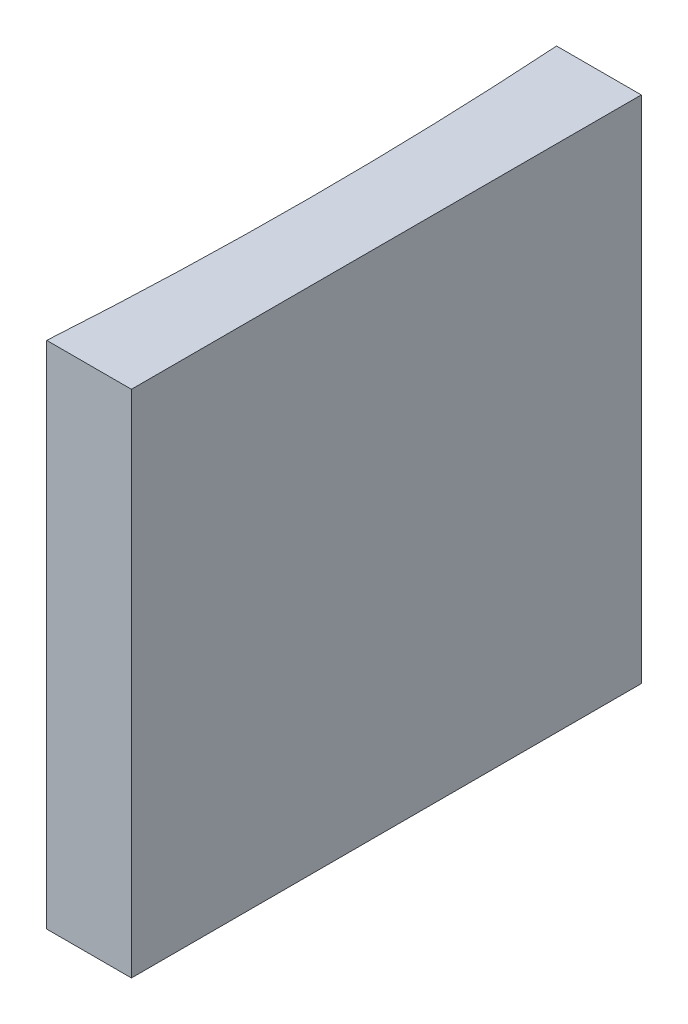
ISO-10303-21;
HEADER;
FILE_DESCRIPTION(('STEP AP214'),'2;1');
FILE_NAME('part.step','',(''),(''),'','','');
FILE_SCHEMA(('AUTOMOTIVE_DESIGN { 1 0 10303 214 1 1 1 1 }'));
ENDSEC;
DATA;
#1=APPLICATION_CONTEXT('core data for automotive mechanical design processes');
#2=APPLICATION_PROTOCOL_DEFINITION('international standard','automotive_design',2000,#1);
#3=PRODUCT_CONTEXT('',#1,'mechanical');
#4=PRODUCT('Part','Part','',(#3));
#5=PRODUCT_RELATED_PRODUCT_CATEGORY('part','',(#4));
#6=PRODUCT_DEFINITION_FORMATION('','',#4);
#7=PRODUCT_DEFINITION_CONTEXT('part definition',#1,'design');
#8=PRODUCT_DEFINITION('design','',#6,#7);
#9=PRODUCT_DEFINITION_SHAPE('','',#8);
#10=(LENGTH_UNIT() NAMED_UNIT(*) SI_UNIT(.MILLI.,.METRE.));
#11=(NAMED_UNIT(*) PLANE_ANGLE_UNIT() SI_UNIT($,.RADIAN.));
#12=(NAMED_UNIT(*) SI_UNIT($,.STERADIAN.) SOLID_ANGLE_UNIT());
#13=UNCERTAINTY_MEASURE_WITH_UNIT(LENGTH_MEASURE(1.E-05),#10,'distance_accuracy_value','');
#14=(GEOMETRIC_REPRESENTATION_CONTEXT(3) GLOBAL_UNCERTAINTY_ASSIGNED_CONTEXT((#13)) GLOBAL_UNIT_ASSIGNED_CONTEXT((#10,
#11,#12)) REPRESENTATION_CONTEXT('',''));
#15=CARTESIAN_POINT('',(0.,0.,0.));
#16=DIRECTION('',(0.,0.,1.));
#17=DIRECTION('',(1.,0.,0.));
#18=AXIS2_PLACEMENT_3D('',#15,#16,#17);
#19=CARTESIAN_POINT('',(0.,20.,0.));
#20=DIRECTION('',(0.,0.,1.));
#21=DIRECTION('',(1.,0.,0.));
#22=AXIS2_PLACEMENT_3D('',#19,#20,#21);
#23=PLANE('',#22);
#24=DIRECTION('',(-1.,0.,0.));
#25=VECTOR('',#24,1.);
#26=CARTESIAN_POINT('',(0.,0.,0.));
#27=LINE('',#26,#25);
#28=CARTESIAN_POINT('',(0.,0.,0.));
#29=VERTEX_POINT('',#28);
#30=CARTESIAN_POINT('',(-3.3227083839493,0.,0.));
#31=VERTEX_POINT('',#30);
#32=EDGE_CURVE('E100',#29,#31,#27,.T.);
#33=ORIENTED_EDGE('',*,*,#32,.T.);
#34=DIRECTION('',(0.,-1.,0.));
#35=VECTOR('',#34,1.);
#36=CARTESIAN_POINT('',(-3.3227083839493,20.,0.));
#37=LINE('',#36,#35);
#38=CARTESIAN_POINT('',(-3.3227083839493,20.,0.));
#39=VERTEX_POINT('',#38);
#40=EDGE_CURVE('E11',#39,#31,#37,.T.);
#41=ORIENTED_EDGE('',*,*,#40,.F.);
#42=DIRECTION('',(-1.,0.,0.));
#43=VECTOR('',#42,1.);
#44=CARTESIAN_POINT('',(0.,20.,0.));
#45=LINE('',#44,#43);
#46=CARTESIAN_POINT('',(0.,20.,0.));
#47=VERTEX_POINT('',#46);
#48=EDGE_CURVE('E88',#47,#39,#45,.T.);
#49=ORIENTED_EDGE('',*,*,#48,.F.);
#50=DIRECTION('',(0.,-1.,0.));
#51=VECTOR('',#50,1.);
#52=CARTESIAN_POINT('',(0.,20.,0.));
#53=LINE('',#52,#51);
#54=EDGE_CURVE('E96',#47,#29,#53,.T.);
#55=ORIENTED_EDGE('',*,*,#54,.T.);
#56=EDGE_LOOP('',(#33,#41,#49,#55));
#57=FACE_BOUND('',#56,.T.);
#58=ADVANCED_FACE('F37',(#57),#23,.F.);
#59=CARTESIAN_POINT('',(-158.1,20.,10.));
#60=DIRECTION('',(0.,-1.,0.));
#61=DIRECTION('',(0.,0.,-1.));
#62=AXIS2_PLACEMENT_3D('',#59,#60,#61);
#63=CYLINDRICAL_SURFACE('',#62,155.1);
#64=CARTESIAN_POINT('',(-158.1,0.,10.));
#65=DIRECTION('',(0.,-1.,0.));
#66=DIRECTION('',(0.,0.,1.));
#67=AXIS2_PLACEMENT_3D('',#64,#65,#66);
#68=CIRCLE('',#67,155.1);
#69=CARTESIAN_POINT('',(-3.3227083839493,0.,20.));
#70=VERTEX_POINT('',#69);
#71=EDGE_CURVE('E92',#31,#70,#68,.T.);
#72=ORIENTED_EDGE('',*,*,#71,.T.);
#73=DIRECTION('',(0.,-1.,0.));
#74=VECTOR('',#73,1.);
#75=CARTESIAN_POINT('',(-3.3227083839493,20.,20.));
#76=LINE('',#75,#74);
#77=CARTESIAN_POINT('',(-3.3227083839493,20.,20.));
#78=VERTEX_POINT('',#77);
#79=EDGE_CURVE('E45',#78,#70,#76,.T.);
#80=ORIENTED_EDGE('',*,*,#79,.F.);
#81=CARTESIAN_POINT('',(-158.1,20.,10.));
#82=DIRECTION('',(0.,-1.,0.));
#83=DIRECTION('',(0.,0.,1.));
#84=AXIS2_PLACEMENT_3D('',#81,#82,#83);
#85=CIRCLE('',#84,155.1);
#86=EDGE_CURVE('E83',#39,#78,#85,.T.);
#87=ORIENTED_EDGE('',*,*,#86,.F.);
#88=ORIENTED_EDGE('',*,*,#40,.T.);
#89=EDGE_LOOP('',(#72,#80,#87,#88));
#90=FACE_BOUND('',#89,.T.);
#91=ADVANCED_FACE('F91',(#90),#63,.F.);
#92=CARTESIAN_POINT('',(0.,20.,20.));
#93=DIRECTION('',(0.,0.,-1.));
#94=DIRECTION('',(-1.,0.,0.));
#95=AXIS2_PLACEMENT_3D('',#92,#93,#94);
#96=PLANE('',#95);
#97=DIRECTION('',(1.,0.,0.));
#98=VECTOR('',#97,1.);
#99=CARTESIAN_POINT('',(0.,0.,20.));
#100=LINE('',#99,#98);
#101=CARTESIAN_POINT('',(0.,0.,20.));
#102=VERTEX_POINT('',#101);
#103=EDGE_CURVE('E70',#70,#102,#100,.T.);
#104=ORIENTED_EDGE('',*,*,#103,.T.);
#105=DIRECTION('',(0.,-1.,0.));
#106=VECTOR('',#105,1.);
#107=CARTESIAN_POINT('',(0.,20.,20.));
#108=LINE('',#107,#106);
#109=CARTESIAN_POINT('',(0.,20.,20.));
#110=VERTEX_POINT('',#109);
#111=EDGE_CURVE('E93',#110,#102,#108,.T.);
#112=ORIENTED_EDGE('',*,*,#111,.F.);
#113=DIRECTION('',(1.,0.,0.));
#114=VECTOR('',#113,1.);
#115=CARTESIAN_POINT('',(0.,20.,20.));
#116=LINE('',#115,#114);
#117=EDGE_CURVE('E86',#78,#110,#116,.T.);
#118=ORIENTED_EDGE('',*,*,#117,.F.);
#119=ORIENTED_EDGE('',*,*,#79,.T.);
#120=EDGE_LOOP('',(#104,#112,#118,#119));
#121=FACE_BOUND('',#120,.T.);
#122=ADVANCED_FACE('F94',(#121),#96,.F.);
#123=CARTESIAN_POINT('',(0.,20.,0.));
#124=DIRECTION('',(-1.,0.,0.));
#125=DIRECTION('',(0.,0.,1.));
#126=AXIS2_PLACEMENT_3D('',#123,#124,#125);
#127=PLANE('',#126);
#128=DIRECTION('',(0.,0.,-1.));
#129=VECTOR('',#128,1.);
#130=CARTESIAN_POINT('',(0.,0.,0.));
#131=LINE('',#130,#129);
#132=EDGE_CURVE('E76',#102,#29,#131,.T.);
#133=ORIENTED_EDGE('',*,*,#132,.T.);
#134=ORIENTED_EDGE('',*,*,#54,.F.);
#135=DIRECTION('',(0.,0.,-1.));
#136=VECTOR('',#135,1.);
#137=CARTESIAN_POINT('',(0.,20.,0.));
#138=LINE('',#137,#136);
#139=EDGE_CURVE('E53',#110,#47,#138,.T.);
#140=ORIENTED_EDGE('',*,*,#139,.F.);
#141=ORIENTED_EDGE('',*,*,#111,.T.);
#142=EDGE_LOOP('',(#133,#134,#140,#141));
#143=FACE_BOUND('',#142,.T.);
#144=ADVANCED_FACE('F107',(#143),#127,.F.);
#145=CARTESIAN_POINT('',(-158.1,20.,10.));
#146=DIRECTION('',(0.,1.,0.));
#147=DIRECTION('',(0.,0.,1.));
#148=AXIS2_PLACEMENT_3D('',#145,#146,#147);
#149=PLANE('',#148);
#150=ORIENTED_EDGE('',*,*,#48,.T.);
#151=ORIENTED_EDGE('',*,*,#86,.T.);
#152=ORIENTED_EDGE('',*,*,#117,.T.);
#153=ORIENTED_EDGE('',*,*,#139,.T.);
#154=EDGE_LOOP('',(#150,#151,#152,#153));
#155=FACE_BOUND('',#154,.T.);
#156=ADVANCED_FACE('F84',(#155),#149,.T.);
#157=CARTESIAN_POINT('',(-158.1,0.,10.));
#158=DIRECTION('',(0.,1.,0.));
#159=DIRECTION('',(0.,0.,1.));
#160=AXIS2_PLACEMENT_3D('',#157,#158,#159);
#161=PLANE('',#160);
#162=ORIENTED_EDGE('',*,*,#32,.F.);
#163=ORIENTED_EDGE('',*,*,#132,.F.);
#164=ORIENTED_EDGE('',*,*,#103,.F.);
#165=ORIENTED_EDGE('',*,*,#71,.F.);
#166=EDGE_LOOP('',(#162,#163,#164,#165));
#167=FACE_BOUND('',#166,.T.);
#168=ADVANCED_FACE('F110',(#167),#161,.F.);
#169=CLOSED_SHELL('',(#58,#91,#122,#144,#156,#168));
#170=MANIFOLD_SOLID_BREP('B2',#169);
#171=ADVANCED_BREP_SHAPE_REPRESENTATION('',(#18,#170),#14);
#172=SHAPE_DEFINITION_REPRESENTATION(#9,#171);
ENDSEC;
END-ISO-10303-21;
